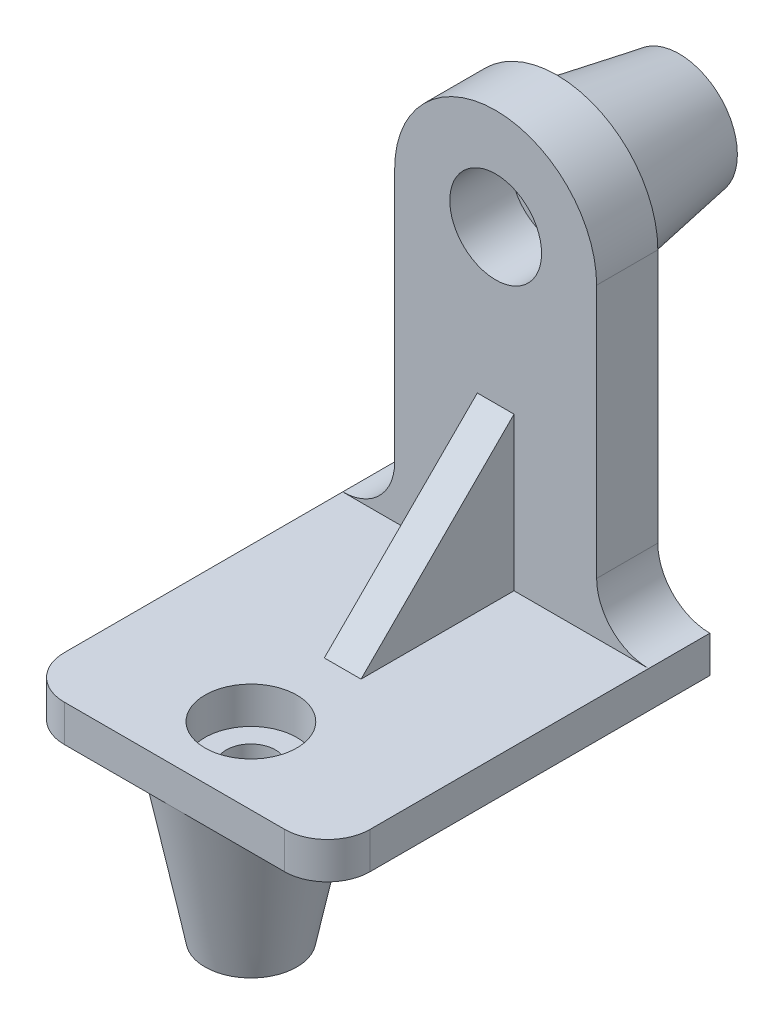
ISO-10303-21;
HEADER;
FILE_DESCRIPTION(('STEP AP214'),'2;1');
FILE_NAME('part.step','',(''),(''),'','','');
FILE_SCHEMA(('AUTOMOTIVE_DESIGN { 1 0 10303 214 1 1 1 1 }'));
ENDSEC;
DATA;
#1=APPLICATION_CONTEXT('core data for automotive mechanical design processes');
#2=APPLICATION_PROTOCOL_DEFINITION('international standard','automotive_design',2000,#1);
#3=PRODUCT_CONTEXT('',#1,'mechanical');
#4=PRODUCT('Part','Part','',(#3));
#5=PRODUCT_RELATED_PRODUCT_CATEGORY('part','',(#4));
#6=PRODUCT_DEFINITION_FORMATION('','',#4);
#7=PRODUCT_DEFINITION_CONTEXT('part definition',#1,'design');
#8=PRODUCT_DEFINITION('design','',#6,#7);
#9=PRODUCT_DEFINITION_SHAPE('','',#8);
#10=(LENGTH_UNIT() NAMED_UNIT(*) SI_UNIT(.MILLI.,.METRE.));
#11=(NAMED_UNIT(*) PLANE_ANGLE_UNIT() SI_UNIT($,.RADIAN.));
#12=(NAMED_UNIT(*) SI_UNIT($,.STERADIAN.) SOLID_ANGLE_UNIT());
#13=UNCERTAINTY_MEASURE_WITH_UNIT(LENGTH_MEASURE(1.E-05),#10,'distance_accuracy_value','');
#14=(GEOMETRIC_REPRESENTATION_CONTEXT(3) GLOBAL_UNCERTAINTY_ASSIGNED_CONTEXT((#13)) GLOBAL_UNIT_ASSIGNED_CONTEXT((#10,
#11,#12)) REPRESENTATION_CONTEXT('',''));
#15=CARTESIAN_POINT('',(0.,0.,0.));
#16=DIRECTION('',(0.,0.,1.));
#17=DIRECTION('',(1.,0.,0.));
#18=AXIS2_PLACEMENT_3D('',#15,#16,#17);
#19=CARTESIAN_POINT('',(50.,17.,0.));
#20=DIRECTION('',(0.,0.,-1.));
#21=DIRECTION('',(-1.,0.,0.));
#22=AXIS2_PLACEMENT_3D('',#19,#20,#21);
#23=PLANE('',#22);
#24=CARTESIAN_POINT('',(0.,100.,0.));
#25=DIRECTION('',(0.,0.,1.));
#26=DIRECTION('',(1.,0.,0.));
#27=AXIS2_PLACEMENT_3D('',#24,#25,#26);
#28=CIRCLE('',#27,15.);
#29=CARTESIAN_POINT('',(15.,100.,0.));
#30=VERTEX_POINT('',#29);
#31=EDGE_CURVE('E211',#30,#30,#28,.T.);
#32=ORIENTED_EDGE('',*,*,#31,.F.);
#33=EDGE_LOOP('',(#32));
#34=FACE_BOUND('',#33,.T.);
#35=DIRECTION('',(0.,1.,0.));
#36=VECTOR('',#35,1.);
#37=CARTESIAN_POINT('',(6.,0.,0.));
#38=LINE('',#37,#36);
#39=CARTESIAN_POINT('',(6.,0.,0.));
#40=VERTEX_POINT('',#39);
#41=CARTESIAN_POINT('',(6.,50.,0.));
#42=VERTEX_POINT('',#41);
#43=EDGE_CURVE('E161',#40,#42,#38,.T.);
#44=ORIENTED_EDGE('',*,*,#43,.F.);
#45=DIRECTION('',(1.,0.,0.));
#46=VECTOR('',#45,1.);
#47=CARTESIAN_POINT('',(-50.,0.,0.));
#48=LINE('',#47,#46);
#49=CARTESIAN_POINT('',(50.,0.,0.));
#50=VERTEX_POINT('',#49);
#51=EDGE_CURVE('E258',#40,#50,#48,.T.);
#52=ORIENTED_EDGE('',*,*,#51,.T.);
#53=CARTESIAN_POINT('',(50.,17.,0.));
#54=DIRECTION('',(0.,0.,-1.));
#55=DIRECTION('',(-1.,0.,0.));
#56=AXIS2_PLACEMENT_3D('',#53,#54,#55);
#57=CIRCLE('',#56,17.);
#58=CARTESIAN_POINT('',(33.,17.,0.));
#59=VERTEX_POINT('',#58);
#60=EDGE_CURVE('E225',#50,#59,#57,.T.);
#61=ORIENTED_EDGE('',*,*,#60,.T.);
#62=DIRECTION('',(0.,1.,0.));
#63=VECTOR('',#62,1.);
#64=CARTESIAN_POINT('',(33.,17.,0.));
#65=LINE('',#64,#63);
#66=CARTESIAN_POINT('',(33.,100.,0.));
#67=VERTEX_POINT('',#66);
#68=EDGE_CURVE('E246',#59,#67,#65,.T.);
#69=ORIENTED_EDGE('',*,*,#68,.T.);
#70=CARTESIAN_POINT('',(0.,100.,0.));
#71=DIRECTION('',(0.,0.,1.));
#72=DIRECTION('',(1.,0.,0.));
#73=AXIS2_PLACEMENT_3D('',#70,#71,#72);
#74=CIRCLE('',#73,33.);
#75=CARTESIAN_POINT('',(-33.,100.,0.));
#76=VERTEX_POINT('',#75);
#77=EDGE_CURVE('E249',#67,#76,#74,.T.);
#78=ORIENTED_EDGE('',*,*,#77,.T.);
#79=DIRECTION('',(0.,-1.,0.));
#80=VECTOR('',#79,1.);
#81=CARTESIAN_POINT('',(-33.,100.,0.));
#82=LINE('',#81,#80);
#83=CARTESIAN_POINT('',(-33.,17.,0.));
#84=VERTEX_POINT('',#83);
#85=EDGE_CURVE('E252',#76,#84,#82,.T.);
#86=ORIENTED_EDGE('',*,*,#85,.T.);
#87=CARTESIAN_POINT('',(-50.,17.,0.));
#88=DIRECTION('',(0.,0.,-1.));
#89=DIRECTION('',(-1.,0.,0.));
#90=AXIS2_PLACEMENT_3D('',#87,#88,#89);
#91=CIRCLE('',#90,17.);
#92=CARTESIAN_POINT('',(-50.,0.,0.));
#93=VERTEX_POINT('',#92);
#94=EDGE_CURVE('E255',#84,#93,#91,.T.);
#95=ORIENTED_EDGE('',*,*,#94,.T.);
#96=CARTESIAN_POINT('',(-6.,0.,0.));
#97=VERTEX_POINT('',#96);
#98=EDGE_CURVE('E232',#93,#97,#48,.T.);
#99=ORIENTED_EDGE('',*,*,#98,.T.);
#100=DIRECTION('',(0.,1.,0.));
#101=VECTOR('',#100,1.);
#102=CARTESIAN_POINT('',(-6.,0.,0.));
#103=LINE('',#102,#101);
#104=CARTESIAN_POINT('',(-6.,50.,0.));
#105=VERTEX_POINT('',#104);
#106=EDGE_CURVE('E158',#97,#105,#103,.T.);
#107=ORIENTED_EDGE('',*,*,#106,.T.);
#108=DIRECTION('',(-1.,0.,0.));
#109=VECTOR('',#108,1.);
#110=CARTESIAN_POINT('',(6.,50.,0.));
#111=LINE('',#110,#109);
#112=EDGE_CURVE('E59',#42,#105,#111,.T.);
#113=ORIENTED_EDGE('',*,*,#112,.F.);
#114=EDGE_LOOP('',(#44,#52,#61,#69,#78,#86,#95,#99,#107,#113));
#115=FACE_BOUND('',#114,.T.);
#116=ADVANCED_FACE('F37',(#34,#115),#23,.F.);
#117=CARTESIAN_POINT('',(-36.,0.,91.));
#118=DIRECTION('',(0.,1.,0.));
#119=DIRECTION('',(0.,0.,1.));
#120=AXIS2_PLACEMENT_3D('',#117,#118,#119);
#121=PLANE('',#120);
#122=CARTESIAN_POINT('',(0.,0.,80.));
#123=DIRECTION('',(0.,1.,0.));
#124=DIRECTION('',(0.,0.,1.));
#125=AXIS2_PLACEMENT_3D('',#122,#123,#124);
#126=CIRCLE('',#125,15.);
#127=CARTESIAN_POINT('',(0.,0.,95.));
#128=VERTEX_POINT('',#127);
#129=EDGE_CURVE('E169',#128,#128,#126,.T.);
#130=ORIENTED_EDGE('',*,*,#129,.F.);
#131=EDGE_LOOP('',(#130));
#132=FACE_BOUND('',#131,.T.);
#133=ORIENTED_EDGE('',*,*,#51,.F.);
#134=DIRECTION('',(0.,0.,-1.));
#135=VECTOR('',#134,1.);
#136=CARTESIAN_POINT('',(6.,0.,50.));
#137=LINE('',#136,#135);
#138=CARTESIAN_POINT('',(6.,0.,50.));
#139=VERTEX_POINT('',#138);
#140=EDGE_CURVE('E149',#139,#40,#137,.T.);
#141=ORIENTED_EDGE('',*,*,#140,.F.);
#142=DIRECTION('',(-1.,0.,0.));
#143=VECTOR('',#142,1.);
#144=CARTESIAN_POINT('',(6.,0.,50.));
#145=LINE('',#144,#143);
#146=CARTESIAN_POINT('',(-6.,0.,50.));
#147=VERTEX_POINT('',#146);
#148=EDGE_CURVE('E141',#139,#147,#145,.T.);
#149=ORIENTED_EDGE('',*,*,#148,.T.);
#150=DIRECTION('',(0.,0.,-1.));
#151=VECTOR('',#150,1.);
#152=CARTESIAN_POINT('',(-6.,0.,50.));
#153=LINE('',#152,#151);
#154=EDGE_CURVE('E146',#147,#97,#153,.T.);
#155=ORIENTED_EDGE('',*,*,#154,.T.);
#156=ORIENTED_EDGE('',*,*,#98,.F.);
#157=DIRECTION('',(0.,0.,1.));
#158=VECTOR('',#157,1.);
#159=CARTESIAN_POINT('',(-50.,0.,-20.));
#160=LINE('',#159,#158);
#161=CARTESIAN_POINT('',(-50.,0.,90.9999999999999));
#162=VERTEX_POINT('',#161);
#163=EDGE_CURVE('E173',#93,#162,#160,.T.);
#164=ORIENTED_EDGE('',*,*,#163,.T.);
#165=CARTESIAN_POINT('',(-36.,0.,91.));
#166=DIRECTION('',(0.,1.,0.));
#167=DIRECTION('',(0.,0.,1.));
#168=AXIS2_PLACEMENT_3D('',#165,#166,#167);
#169=CIRCLE('',#168,14.);
#170=CARTESIAN_POINT('',(-36.,0.,105.));
#171=VERTEX_POINT('',#170);
#172=EDGE_CURVE('E198',#162,#171,#169,.T.);
#173=ORIENTED_EDGE('',*,*,#172,.T.);
#174=DIRECTION('',(1.,0.,0.));
#175=VECTOR('',#174,1.);
#176=CARTESIAN_POINT('',(-35.9999999999999,0.,105.));
#177=LINE('',#176,#175);
#178=CARTESIAN_POINT('',(35.9999999999999,0.,105.));
#179=VERTEX_POINT('',#178);
#180=EDGE_CURVE('E201',#171,#179,#177,.T.);
#181=ORIENTED_EDGE('',*,*,#180,.T.);
#182=CARTESIAN_POINT('',(36.,0.,91.));
#183=DIRECTION('',(0.,1.,0.));
#184=DIRECTION('',(0.,0.,1.));
#185=AXIS2_PLACEMENT_3D('',#182,#183,#184);
#186=CIRCLE('',#185,14.);
#187=CARTESIAN_POINT('',(50.,0.,90.9999999999999));
#188=VERTEX_POINT('',#187);
#189=EDGE_CURVE('E204',#179,#188,#186,.T.);
#190=ORIENTED_EDGE('',*,*,#189,.T.);
#191=DIRECTION('',(0.,0.,-1.));
#192=VECTOR('',#191,1.);
#193=CARTESIAN_POINT('',(50.,0.,90.9999999999999));
#194=LINE('',#193,#192);
#195=EDGE_CURVE('E180',#188,#50,#194,.T.);
#196=ORIENTED_EDGE('',*,*,#195,.T.);
#197=EDGE_LOOP('',(#133,#141,#149,#155,#156,#164,#173,#181,#190,#196));
#198=FACE_BOUND('',#197,.T.);
#199=ADVANCED_FACE('F144',(#132,#198),#121,.T.);
#200=CARTESIAN_POINT('',(50.,17.,-20.));
#201=DIRECTION('',(0.,0.,1.));
#202=DIRECTION('',(1.,0.,0.));
#203=AXIS2_PLACEMENT_3D('',#200,#201,#202);
#204=CYLINDRICAL_SURFACE('',#203,17.);
#205=ORIENTED_EDGE('',*,*,#60,.F.);
#206=DIRECTION('',(0.,0.,1.));
#207=VECTOR('',#206,1.);
#208=CARTESIAN_POINT('',(50.,0.,-20.));
#209=LINE('',#208,#207);
#210=CARTESIAN_POINT('',(50.,0.,-20.));
#211=VERTEX_POINT('',#210);
#212=EDGE_CURVE('E11',#211,#50,#209,.T.);
#213=ORIENTED_EDGE('',*,*,#212,.F.);
#214=CARTESIAN_POINT('',(50.,17.,-20.));
#215=DIRECTION('',(0.,0.,-1.));
#216=DIRECTION('',(-1.,0.,0.));
#217=AXIS2_PLACEMENT_3D('',#214,#215,#216);
#218=CIRCLE('',#217,17.);
#219=CARTESIAN_POINT('',(33.,17.,-20.));
#220=VERTEX_POINT('',#219);
#221=EDGE_CURVE('E228',#211,#220,#218,.T.);
#222=ORIENTED_EDGE('',*,*,#221,.T.);
#223=DIRECTION('',(0.,0.,1.));
#224=VECTOR('',#223,1.);
#225=CARTESIAN_POINT('',(33.,17.,-20.));
#226=LINE('',#225,#224);
#227=EDGE_CURVE('E41',#220,#59,#226,.T.);
#228=ORIENTED_EDGE('',*,*,#227,.T.);
#229=EDGE_LOOP('',(#205,#213,#222,#228));
#230=FACE_BOUND('',#229,.T.);
#231=ADVANCED_FACE('F39',(#230),#204,.F.);
#232=CARTESIAN_POINT('',(-50.,17.,-20.));
#233=DIRECTION('',(0.,0.,1.));
#234=DIRECTION('',(1.,0.,0.));
#235=AXIS2_PLACEMENT_3D('',#232,#233,#234);
#236=CYLINDRICAL_SURFACE('',#235,17.);
#237=ORIENTED_EDGE('',*,*,#94,.F.);
#238=DIRECTION('',(0.,0.,1.));
#239=VECTOR('',#238,1.);
#240=CARTESIAN_POINT('',(-33.,17.,-20.));
#241=LINE('',#240,#239);
#242=CARTESIAN_POINT('',(-33.,17.,-20.));
#243=VERTEX_POINT('',#242);
#244=EDGE_CURVE('E262',#243,#84,#241,.T.);
#245=ORIENTED_EDGE('',*,*,#244,.F.);
#246=CARTESIAN_POINT('',(-50.,17.,-20.));
#247=DIRECTION('',(0.,0.,-1.));
#248=DIRECTION('',(-1.,0.,0.));
#249=AXIS2_PLACEMENT_3D('',#246,#247,#248);
#250=CIRCLE('',#249,17.);
#251=CARTESIAN_POINT('',(-50.,0.,-20.));
#252=VERTEX_POINT('',#251);
#253=EDGE_CURVE('E241',#243,#252,#250,.T.);
#254=ORIENTED_EDGE('',*,*,#253,.T.);
#255=DIRECTION('',(0.,0.,1.));
#256=VECTOR('',#255,1.);
#257=CARTESIAN_POINT('',(-50.,0.,-20.));
#258=LINE('',#257,#256);
#259=EDGE_CURVE('E46',#252,#93,#258,.T.);
#260=ORIENTED_EDGE('',*,*,#259,.T.);
#261=EDGE_LOOP('',(#237,#245,#254,#260));
#262=FACE_BOUND('',#261,.T.);
#263=ADVANCED_FACE('F292',(#262),#236,.F.);
#264=CARTESIAN_POINT('',(-33.,100.,-20.));
#265=DIRECTION('',(-1.,0.,0.));
#266=DIRECTION('',(0.,-1.,0.));
#267=AXIS2_PLACEMENT_3D('',#264,#265,#266);
#268=PLANE('',#267);
#269=ORIENTED_EDGE('',*,*,#85,.F.);
#270=DIRECTION('',(0.,0.,1.));
#271=VECTOR('',#270,1.);
#272=CARTESIAN_POINT('',(-33.,100.,-20.));
#273=LINE('',#272,#271);
#274=CARTESIAN_POINT('',(-33.,100.,-20.));
#275=VERTEX_POINT('',#274);
#276=EDGE_CURVE('E264',#275,#76,#273,.T.);
#277=ORIENTED_EDGE('',*,*,#276,.F.);
#278=DIRECTION('',(0.,-1.,0.));
#279=VECTOR('',#278,1.);
#280=CARTESIAN_POINT('',(-33.,100.,-20.));
#281=LINE('',#280,#279);
#282=EDGE_CURVE('E238',#275,#243,#281,.T.);
#283=ORIENTED_EDGE('',*,*,#282,.T.);
#284=ORIENTED_EDGE('',*,*,#244,.T.);
#285=EDGE_LOOP('',(#269,#277,#283,#284));
#286=FACE_BOUND('',#285,.T.);
#287=ADVANCED_FACE('F290',(#286),#268,.T.);
#288=CARTESIAN_POINT('',(0.,100.,-20.));
#289=DIRECTION('',(0.,0.,1.));
#290=DIRECTION('',(1.,0.,0.));
#291=AXIS2_PLACEMENT_3D('',#288,#289,#290);
#292=CYLINDRICAL_SURFACE('',#291,33.);
#293=ORIENTED_EDGE('',*,*,#77,.F.);
#294=DIRECTION('',(0.,0.,1.));
#295=VECTOR('',#294,1.);
#296=CARTESIAN_POINT('',(33.,100.,-20.));
#297=LINE('',#296,#295);
#298=CARTESIAN_POINT('',(33.,100.,-20.));
#299=VERTEX_POINT('',#298);
#300=EDGE_CURVE('E265',#299,#67,#297,.T.);
#301=ORIENTED_EDGE('',*,*,#300,.F.);
#302=CARTESIAN_POINT('',(0.,100.,-20.));
#303=DIRECTION('',(0.,0.,1.));
#304=DIRECTION('',(1.,0.,0.));
#305=AXIS2_PLACEMENT_3D('',#302,#303,#304);
#306=CIRCLE('',#305,33.);
#307=EDGE_CURVE('E235',#299,#275,#306,.T.);
#308=ORIENTED_EDGE('',*,*,#307,.T.);
#309=ORIENTED_EDGE('',*,*,#276,.T.);
#310=EDGE_LOOP('',(#293,#301,#308,#309));
#311=FACE_BOUND('',#310,.T.);
#312=ADVANCED_FACE('F286',(#311),#292,.T.);
#313=CARTESIAN_POINT('',(33.,17.,-20.));
#314=DIRECTION('',(1.,0.,0.));
#315=DIRECTION('',(0.,1.,0.));
#316=AXIS2_PLACEMENT_3D('',#313,#314,#315);
#317=PLANE('',#316);
#318=ORIENTED_EDGE('',*,*,#68,.F.);
#319=ORIENTED_EDGE('',*,*,#227,.F.);
#320=DIRECTION('',(0.,1.,0.));
#321=VECTOR('',#320,1.);
#322=CARTESIAN_POINT('',(33.,17.,-20.));
#323=LINE('',#322,#321);
#324=EDGE_CURVE('E231',#220,#299,#323,.T.);
#325=ORIENTED_EDGE('',*,*,#324,.T.);
#326=ORIENTED_EDGE('',*,*,#300,.T.);
#327=EDGE_LOOP('',(#318,#319,#325,#326));
#328=FACE_BOUND('',#327,.T.);
#329=ADVANCED_FACE('F274',(#328),#317,.T.);
#330=CARTESIAN_POINT('',(50.,17.,-20.));
#331=DIRECTION('',(0.,0.,-1.));
#332=DIRECTION('',(-1.,0.,0.));
#333=AXIS2_PLACEMENT_3D('',#330,#331,#332);
#334=PLANE('',#333);
#335=CARTESIAN_POINT('',(0.,100.,-20.));
#336=DIRECTION('',(0.,0.,1.));
#337=DIRECTION('',(1.,0.,0.));
#338=AXIS2_PLACEMENT_3D('',#335,#336,#337);
#339=CIRCLE('',#338,26.);
#340=CARTESIAN_POINT('',(26.,100.,-20.));
#341=VERTEX_POINT('',#340);
#342=EDGE_CURVE('E311',#341,#341,#339,.T.);
#343=ORIENTED_EDGE('',*,*,#342,.T.);
#344=EDGE_LOOP('',(#343));
#345=FACE_BOUND('',#344,.T.);
#346=ORIENTED_EDGE('',*,*,#221,.F.);
#347=DIRECTION('',(0.,1.,0.));
#348=VECTOR('',#347,1.);
#349=CARTESIAN_POINT('',(50.,-12.,-20.));
#350=LINE('',#349,#348);
#351=CARTESIAN_POINT('',(50.,-12.,-20.));
#352=VERTEX_POINT('',#351);
#353=EDGE_CURVE('E209',#352,#211,#350,.T.);
#354=ORIENTED_EDGE('',*,*,#353,.F.);
#355=DIRECTION('',(-1.,0.,0.));
#356=VECTOR('',#355,1.);
#357=CARTESIAN_POINT('',(50.,-12.,-20.));
#358=LINE('',#357,#356);
#359=CARTESIAN_POINT('',(-50.,-12.,-20.));
#360=VERTEX_POINT('',#359);
#361=EDGE_CURVE('E176',#352,#360,#358,.T.);
#362=ORIENTED_EDGE('',*,*,#361,.T.);
#363=DIRECTION('',(0.,1.,0.));
#364=VECTOR('',#363,1.);
#365=CARTESIAN_POINT('',(-50.,-12.,-20.));
#366=LINE('',#365,#364);
#367=EDGE_CURVE('E196',#360,#252,#366,.T.);
#368=ORIENTED_EDGE('',*,*,#367,.T.);
#369=ORIENTED_EDGE('',*,*,#253,.F.);
#370=ORIENTED_EDGE('',*,*,#282,.F.);
#371=ORIENTED_EDGE('',*,*,#307,.F.);
#372=ORIENTED_EDGE('',*,*,#324,.F.);
#373=EDGE_LOOP('',(#346,#354,#362,#368,#369,#370,#371,#372));
#374=FACE_BOUND('',#373,.T.);
#375=ADVANCED_FACE('F280',(#345,#374),#334,.T.);
#376=CARTESIAN_POINT('',(0.,100.,-20.));
#377=DIRECTION('',(0.,0.,1.));
#378=DIRECTION('',(1.,0.,0.));
#379=AXIS2_PLACEMENT_3D('',#376,#377,#378);
#380=CYLINDRICAL_SURFACE('',#379,15.);
#381=CARTESIAN_POINT('',(0.,100.,-20.));
#382=DIRECTION('',(0.,0.,1.));
#383=DIRECTION('',(1.,0.,0.));
#384=AXIS2_PLACEMENT_3D('',#381,#382,#383);
#385=CIRCLE('',#384,15.);
#386=CARTESIAN_POINT('',(15.,100.,-20.));
#387=VERTEX_POINT('',#386);
#388=EDGE_CURVE('E222',#387,#387,#385,.T.);
#389=ORIENTED_EDGE('',*,*,#388,.F.);
#390=EDGE_LOOP('',(#389));
#391=FACE_BOUND('',#390,.T.);
#392=ORIENTED_EDGE('',*,*,#31,.T.);
#393=EDGE_LOOP('',(#392));
#394=FACE_BOUND('',#393,.T.);
#395=ADVANCED_FACE('F345',(#391,#394),#380,.F.);
#396=CARTESIAN_POINT('',(50.,-12.,90.9999999999999));
#397=DIRECTION('',(1.,0.,0.));
#398=DIRECTION('',(0.,0.,-1.));
#399=AXIS2_PLACEMENT_3D('',#396,#397,#398);
#400=PLANE('',#399);
#401=ORIENTED_EDGE('',*,*,#195,.F.);
#402=DIRECTION('',(0.,1.,0.));
#403=VECTOR('',#402,1.);
#404=CARTESIAN_POINT('',(50.,-12.,90.9999999999999));
#405=LINE('',#404,#403);
#406=CARTESIAN_POINT('',(50.,-12.,90.9999999999999));
#407=VERTEX_POINT('',#406);
#408=EDGE_CURVE('E212',#407,#188,#405,.T.);
#409=ORIENTED_EDGE('',*,*,#408,.F.);
#410=DIRECTION('',(0.,0.,-1.));
#411=VECTOR('',#410,1.);
#412=CARTESIAN_POINT('',(50.,-12.,90.9999999999999));
#413=LINE('',#412,#411);
#414=EDGE_CURVE('E193',#407,#352,#413,.T.);
#415=ORIENTED_EDGE('',*,*,#414,.T.);
#416=ORIENTED_EDGE('',*,*,#353,.T.);
#417=ORIENTED_EDGE('',*,*,#212,.T.);
#418=EDGE_LOOP('',(#401,#409,#415,#416,#417));
#419=FACE_BOUND('',#418,.T.);
#420=ADVANCED_FACE('F278',(#419),#400,.T.);
#421=CARTESIAN_POINT('',(36.,-12.,91.));
#422=DIRECTION('',(0.,1.,0.));
#423=DIRECTION('',(0.,0.,1.));
#424=AXIS2_PLACEMENT_3D('',#421,#422,#423);
#425=CYLINDRICAL_SURFACE('',#424,14.);
#426=ORIENTED_EDGE('',*,*,#189,.F.);
#427=DIRECTION('',(0.,1.,0.));
#428=VECTOR('',#427,1.);
#429=CARTESIAN_POINT('',(35.9999999999999,-12.,105.));
#430=LINE('',#429,#428);
#431=CARTESIAN_POINT('',(35.9999999999999,-12.,105.));
#432=VERTEX_POINT('',#431);
#433=EDGE_CURVE('E214',#432,#179,#430,.T.);
#434=ORIENTED_EDGE('',*,*,#433,.F.);
#435=CARTESIAN_POINT('',(36.,-12.,91.));
#436=DIRECTION('',(0.,1.,0.));
#437=DIRECTION('',(0.,0.,1.));
#438=AXIS2_PLACEMENT_3D('',#435,#436,#437);
#439=CIRCLE('',#438,14.);
#440=EDGE_CURVE('E190',#432,#407,#439,.T.);
#441=ORIENTED_EDGE('',*,*,#440,.T.);
#442=ORIENTED_EDGE('',*,*,#408,.T.);
#443=EDGE_LOOP('',(#426,#434,#441,#442));
#444=FACE_BOUND('',#443,.T.);
#445=ADVANCED_FACE('F337',(#444),#425,.T.);
#446=CARTESIAN_POINT('',(-35.9999999999999,-12.,105.));
#447=DIRECTION('',(0.,0.,1.));
#448=DIRECTION('',(1.,0.,0.));
#449=AXIS2_PLACEMENT_3D('',#446,#447,#448);
#450=PLANE('',#449);
#451=ORIENTED_EDGE('',*,*,#180,.F.);
#452=DIRECTION('',(0.,1.,0.));
#453=VECTOR('',#452,1.);
#454=CARTESIAN_POINT('',(-36.,-12.,105.));
#455=LINE('',#454,#453);
#456=CARTESIAN_POINT('',(-36.,-12.,105.));
#457=VERTEX_POINT('',#456);
#458=EDGE_CURVE('E216',#457,#171,#455,.T.);
#459=ORIENTED_EDGE('',*,*,#458,.F.);
#460=DIRECTION('',(1.,0.,0.));
#461=VECTOR('',#460,1.);
#462=CARTESIAN_POINT('',(-35.9999999999999,-12.,105.));
#463=LINE('',#462,#461);
#464=CARTESIAN_POINT('',(0.,-12.,105.));
#465=VERTEX_POINT('',#464);
#466=EDGE_CURVE('E187',#457,#465,#463,.T.);
#467=ORIENTED_EDGE('',*,*,#466,.T.);
#468=EDGE_CURVE('E186',#465,#432,#463,.T.);
#469=ORIENTED_EDGE('',*,*,#468,.T.);
#470=ORIENTED_EDGE('',*,*,#433,.T.);
#471=EDGE_LOOP('',(#451,#459,#467,#469,#470));
#472=FACE_BOUND('',#471,.T.);
#473=ADVANCED_FACE('F333',(#472),#450,.T.);
#474=CARTESIAN_POINT('',(-36.,-12.,91.));
#475=DIRECTION('',(0.,1.,0.));
#476=DIRECTION('',(0.,0.,1.));
#477=AXIS2_PLACEMENT_3D('',#474,#475,#476);
#478=CYLINDRICAL_SURFACE('',#477,14.);
#479=ORIENTED_EDGE('',*,*,#172,.F.);
#480=DIRECTION('',(0.,1.,0.));
#481=VECTOR('',#480,1.);
#482=CARTESIAN_POINT('',(-50.,-12.,90.9999999999999));
#483=LINE('',#482,#481);
#484=CARTESIAN_POINT('',(-50.,-12.,90.9999999999999));
#485=VERTEX_POINT('',#484);
#486=EDGE_CURVE('E218',#485,#162,#483,.T.);
#487=ORIENTED_EDGE('',*,*,#486,.F.);
#488=CARTESIAN_POINT('',(-36.,-12.,91.));
#489=DIRECTION('',(0.,1.,0.));
#490=DIRECTION('',(0.,0.,1.));
#491=AXIS2_PLACEMENT_3D('',#488,#489,#490);
#492=CIRCLE('',#491,14.);
#493=EDGE_CURVE('E183',#485,#457,#492,.T.);
#494=ORIENTED_EDGE('',*,*,#493,.T.);
#495=ORIENTED_EDGE('',*,*,#458,.T.);
#496=EDGE_LOOP('',(#479,#487,#494,#495));
#497=FACE_BOUND('',#496,.T.);
#498=ADVANCED_FACE('F335',(#497),#478,.T.);
#499=CARTESIAN_POINT('',(-50.,-12.,-20.));
#500=DIRECTION('',(-1.,0.,0.));
#501=DIRECTION('',(0.,0.,1.));
#502=AXIS2_PLACEMENT_3D('',#499,#500,#501);
#503=PLANE('',#502);
#504=ORIENTED_EDGE('',*,*,#259,.F.);
#505=ORIENTED_EDGE('',*,*,#367,.F.);
#506=DIRECTION('',(0.,0.,1.));
#507=VECTOR('',#506,1.);
#508=CARTESIAN_POINT('',(-50.,-12.,-20.));
#509=LINE('',#508,#507);
#510=EDGE_CURVE('E179',#360,#485,#509,.T.);
#511=ORIENTED_EDGE('',*,*,#510,.T.);
#512=ORIENTED_EDGE('',*,*,#486,.T.);
#513=ORIENTED_EDGE('',*,*,#163,.F.);
#514=EDGE_LOOP('',(#504,#505,#511,#512,#513));
#515=FACE_BOUND('',#514,.T.);
#516=ADVANCED_FACE('F296',(#515),#503,.T.);
#517=CARTESIAN_POINT('',(-36.,-12.,91.));
#518=DIRECTION('',(0.,1.,0.));
#519=DIRECTION('',(0.,0.,1.));
#520=AXIS2_PLACEMENT_3D('',#517,#518,#519);
#521=PLANE('',#520);
#522=ORIENTED_EDGE('',*,*,#468,.F.);
#523=CARTESIAN_POINT('',(0.,-12.,80.));
#524=DIRECTION('',(0.,1.,0.));
#525=DIRECTION('',(0.,0.,1.));
#526=AXIS2_PLACEMENT_3D('',#523,#524,#525);
#527=CIRCLE('',#526,25.);
#528=EDGE_CURVE('E52',#465,#465,#527,.T.);
#529=ORIENTED_EDGE('',*,*,#528,.T.);
#530=ORIENTED_EDGE('',*,*,#466,.F.);
#531=ORIENTED_EDGE('',*,*,#493,.F.);
#532=ORIENTED_EDGE('',*,*,#510,.F.);
#533=ORIENTED_EDGE('',*,*,#361,.F.);
#534=ORIENTED_EDGE('',*,*,#414,.F.);
#535=ORIENTED_EDGE('',*,*,#440,.F.);
#536=EDGE_LOOP('',(#522,#529,#530,#531,#532,#533,#534,#535));
#537=FACE_BOUND('',#536,.T.);
#538=ADVANCED_FACE('F326',(#537),#521,.F.);
#539=CARTESIAN_POINT('',(0.,-12.,80.));
#540=DIRECTION('',(0.,1.,0.));
#541=DIRECTION('',(0.,0.,1.));
#542=AXIS2_PLACEMENT_3D('',#539,#540,#541);
#543=CYLINDRICAL_SURFACE('',#542,15.);
#544=CARTESIAN_POINT('',(0.,-12.,80.));
#545=DIRECTION('',(0.,1.,0.));
#546=DIRECTION('',(0.,0.,1.));
#547=AXIS2_PLACEMENT_3D('',#544,#545,#546);
#548=CIRCLE('',#547,15.);
#549=CARTESIAN_POINT('',(0.,-12.,95.));
#550=VERTEX_POINT('',#549);
#551=EDGE_CURVE('E170',#550,#550,#548,.T.);
#552=ORIENTED_EDGE('',*,*,#551,.F.);
#553=EDGE_LOOP('',(#552));
#554=FACE_BOUND('',#553,.T.);
#555=ORIENTED_EDGE('',*,*,#129,.T.);
#556=EDGE_LOOP('',(#555));
#557=FACE_BOUND('',#556,.T.);
#558=ADVANCED_FACE('F400',(#554,#557),#543,.F.);
#559=CARTESIAN_POINT('',(6.,50.,0.));
#560=DIRECTION('',(0.,-0.707106781186548,-0.707106781186548));
#561=DIRECTION('',(0.,0.707106781186548,-0.707106781186548));
#562=AXIS2_PLACEMENT_3D('',#559,#560,#561);
#563=PLANE('',#562);
#564=DIRECTION('',(0.,-0.707106781186547,0.707106781186547));
#565=VECTOR('',#564,1.);
#566=CARTESIAN_POINT('',(-6.,50.,0.));
#567=LINE('',#566,#565);
#568=EDGE_CURVE('E154',#105,#147,#567,.T.);
#569=ORIENTED_EDGE('',*,*,#568,.T.);
#570=ORIENTED_EDGE('',*,*,#148,.F.);
#571=DIRECTION('',(0.,-0.707106781186547,0.707106781186547));
#572=VECTOR('',#571,1.);
#573=CARTESIAN_POINT('',(6.,50.,0.));
#574=LINE('',#573,#572);
#575=EDGE_CURVE('E164',#42,#139,#574,.T.);
#576=ORIENTED_EDGE('',*,*,#575,.F.);
#577=ORIENTED_EDGE('',*,*,#112,.T.);
#578=EDGE_LOOP('',(#569,#570,#576,#577));
#579=FACE_BOUND('',#578,.T.);
#580=ADVANCED_FACE('F155',(#579),#563,.F.);
#581=CARTESIAN_POINT('',(6.,0.,0.));
#582=DIRECTION('',(-1.,0.,0.));
#583=DIRECTION('',(0.,0.,1.));
#584=AXIS2_PLACEMENT_3D('',#581,#582,#583);
#585=PLANE('',#584);
#586=ORIENTED_EDGE('',*,*,#43,.T.);
#587=ORIENTED_EDGE('',*,*,#575,.T.);
#588=ORIENTED_EDGE('',*,*,#140,.T.);
#589=EDGE_LOOP('',(#586,#587,#588));
#590=FACE_BOUND('',#589,.T.);
#591=ADVANCED_FACE('F392',(#590),#585,.F.);
#592=CARTESIAN_POINT('',(-6.,0.,0.));
#593=DIRECTION('',(-1.,0.,0.));
#594=DIRECTION('',(0.,0.,1.));
#595=AXIS2_PLACEMENT_3D('',#592,#593,#594);
#596=PLANE('',#595);
#597=ORIENTED_EDGE('',*,*,#106,.F.);
#598=ORIENTED_EDGE('',*,*,#154,.F.);
#599=ORIENTED_EDGE('',*,*,#568,.F.);
#600=EDGE_LOOP('',(#597,#598,#599));
#601=FACE_BOUND('',#600,.T.);
#602=ADVANCED_FACE('F160',(#601),#596,.T.);
#603=CARTESIAN_POINT('',(0.,126.,-20.));
#604=DIRECTION('',(0.,0.,-1.));
#605=DIRECTION('',(-1.,0.,0.));
#606=AXIS2_PLACEMENT_3D('',#603,#604,#605);
#607=PLANE('',#606);
#608=CARTESIAN_POINT('',(0.,100.,-20.));
#609=DIRECTION('',(0.,0.,1.));
#610=DIRECTION('',(1.,0.,0.));
#611=AXIS2_PLACEMENT_3D('',#608,#609,#610);
#612=CIRCLE('',#611,9.99999999999999);
#613=CARTESIAN_POINT('',(9.99999999999999,100.,-20.));
#614=VERTEX_POINT('',#613);
#615=EDGE_CURVE('E308',#614,#614,#612,.T.);
#616=ORIENTED_EDGE('',*,*,#615,.F.);
#617=EDGE_LOOP('',(#616));
#618=FACE_BOUND('',#617,.T.);
#619=ORIENTED_EDGE('',*,*,#388,.T.);
#620=EDGE_LOOP('',(#619));
#621=FACE_BOUND('',#620,.T.);
#622=ADVANCED_FACE('F378',(#618,#621),#607,.F.);
#623=CARTESIAN_POINT('',(0.,100.,-20.));
#624=DIRECTION('',(0.,0.,1.));
#625=DIRECTION('',(1.,0.,0.));
#626=AXIS2_PLACEMENT_3D('',#623,#624,#625);
#627=CONICAL_SURFACE('',#626,26.,0.173245666452365);
#628=CARTESIAN_POINT('',(0.,100.,-60.));
#629=DIRECTION('',(0.,0.,1.));
#630=DIRECTION('',(1.,0.,0.));
#631=AXIS2_PLACEMENT_3D('',#628,#629,#630);
#632=CIRCLE('',#631,19.);
#633=CARTESIAN_POINT('',(19.,100.,-60.));
#634=VERTEX_POINT('',#633);
#635=EDGE_CURVE('E299',#634,#634,#632,.T.);
#636=ORIENTED_EDGE('',*,*,#635,.T.);
#637=EDGE_LOOP('',(#636));
#638=FACE_BOUND('',#637,.T.);
#639=ORIENTED_EDGE('',*,*,#342,.F.);
#640=EDGE_LOOP('',(#639));
#641=FACE_BOUND('',#640,.T.);
#642=ADVANCED_FACE('F375',(#638,#641),#627,.T.);
#643=CARTESIAN_POINT('',(0.,119.,-60.));
#644=DIRECTION('',(0.,0.,-1.));
#645=DIRECTION('',(-1.,0.,0.));
#646=AXIS2_PLACEMENT_3D('',#643,#644,#645);
#647=PLANE('',#646);
#648=CARTESIAN_POINT('',(0.,100.,-60.));
#649=DIRECTION('',(0.,0.,1.));
#650=DIRECTION('',(1.,0.,0.));
#651=AXIS2_PLACEMENT_3D('',#648,#649,#650);
#652=CIRCLE('',#651,9.99999999999999);
#653=CARTESIAN_POINT('',(9.99999999999999,100.,-60.));
#654=VERTEX_POINT('',#653);
#655=EDGE_CURVE('E301',#654,#654,#652,.T.);
#656=ORIENTED_EDGE('',*,*,#655,.T.);
#657=EDGE_LOOP('',(#656));
#658=FACE_BOUND('',#657,.T.);
#659=ORIENTED_EDGE('',*,*,#635,.F.);
#660=EDGE_LOOP('',(#659));
#661=FACE_BOUND('',#660,.T.);
#662=ADVANCED_FACE('F377',(#658,#661),#647,.T.);
#663=CARTESIAN_POINT('',(0.,100.,0.));
#664=DIRECTION('',(0.,0.,1.));
#665=DIRECTION('',(1.,0.,0.));
#666=AXIS2_PLACEMENT_3D('',#663,#664,#665);
#667=CYLINDRICAL_SURFACE('',#666,9.99999999999999);
#668=ORIENTED_EDGE('',*,*,#615,.T.);
#669=EDGE_LOOP('',(#668));
#670=FACE_BOUND('',#669,.T.);
#671=ORIENTED_EDGE('',*,*,#655,.F.);
#672=EDGE_LOOP('',(#671));
#673=FACE_BOUND('',#672,.T.);
#674=ADVANCED_FACE('F385',(#670,#673),#667,.F.);
#675=CARTESIAN_POINT('',(0.,-12.,88.));
#676=DIRECTION('',(0.,1.,0.));
#677=DIRECTION('',(0.,0.,1.));
#678=AXIS2_PLACEMENT_3D('',#675,#676,#677);
#679=PLANE('',#678);
#680=ORIENTED_EDGE('',*,*,#551,.T.);
#681=EDGE_LOOP('',(#680));
#682=FACE_BOUND('',#681,.T.);
#683=CARTESIAN_POINT('',(0.,-12.,80.));
#684=DIRECTION('',(0.,1.,0.));
#685=DIRECTION('',(0.,0.,1.));
#686=AXIS2_PLACEMENT_3D('',#683,#684,#685);
#687=CIRCLE('',#686,7.99999999999999);
#688=CARTESIAN_POINT('',(0.,-12.,88.));
#689=VERTEX_POINT('',#688);
#690=EDGE_CURVE('E314',#689,#689,#687,.T.);
#691=ORIENTED_EDGE('',*,*,#690,.F.);
#692=EDGE_LOOP('',(#691));
#693=FACE_BOUND('',#692,.T.);
#694=ADVANCED_FACE('F436',(#682,#693),#679,.T.);
#695=CARTESIAN_POINT('',(0.,-12.,80.));
#696=DIRECTION('',(0.,1.,0.));
#697=DIRECTION('',(0.,0.,1.));
#698=AXIS2_PLACEMENT_3D('',#695,#696,#697);
#699=CYLINDRICAL_SURFACE('',#698,7.99999999999999);
#700=ORIENTED_EDGE('',*,*,#690,.T.);
#701=EDGE_LOOP('',(#700));
#702=FACE_BOUND('',#701,.T.);
#703=CARTESIAN_POINT('',(0.,-62.,80.));
#704=DIRECTION('',(0.,1.,0.));
#705=DIRECTION('',(0.,0.,1.));
#706=AXIS2_PLACEMENT_3D('',#703,#704,#705);
#707=CIRCLE('',#706,8.);
#708=CARTESIAN_POINT('',(0.,-62.,88.));
#709=VERTEX_POINT('',#708);
#710=EDGE_CURVE('E317',#709,#709,#707,.T.);
#711=ORIENTED_EDGE('',*,*,#710,.F.);
#712=EDGE_LOOP('',(#711));
#713=FACE_BOUND('',#712,.T.);
#714=ADVANCED_FACE('F441',(#702,#713),#699,.F.);
#715=CARTESIAN_POINT('',(0.,-62.,95.));
#716=DIRECTION('',(0.,-1.,0.));
#717=DIRECTION('',(0.,0.,-1.));
#718=AXIS2_PLACEMENT_3D('',#715,#716,#717);
#719=PLANE('',#718);
#720=ORIENTED_EDGE('',*,*,#710,.T.);
#721=EDGE_LOOP('',(#720));
#722=FACE_BOUND('',#721,.T.);
#723=CARTESIAN_POINT('',(0.,-62.,80.));
#724=DIRECTION('',(0.,1.,0.));
#725=DIRECTION('',(0.,0.,1.));
#726=AXIS2_PLACEMENT_3D('',#723,#724,#725);
#727=CIRCLE('',#726,15.);
#728=CARTESIAN_POINT('',(0.,-62.,95.));
#729=VERTEX_POINT('',#728);
#730=EDGE_CURVE('E320',#729,#729,#727,.T.);
#731=ORIENTED_EDGE('',*,*,#730,.F.);
#732=EDGE_LOOP('',(#731));
#733=FACE_BOUND('',#732,.T.);
#734=ADVANCED_FACE('F451',(#722,#733),#719,.T.);
#735=CARTESIAN_POINT('',(0.,-12.,80.));
#736=DIRECTION('',(0.,1.,0.));
#737=DIRECTION('',(0.,0.,1.));
#738=AXIS2_PLACEMENT_3D('',#735,#736,#737);
#739=CONICAL_SURFACE('',#738,25.,0.197395559849881);
#740=ORIENTED_EDGE('',*,*,#730,.T.);
#741=EDGE_LOOP('',(#740));
#742=FACE_BOUND('',#741,.T.);
#743=ORIENTED_EDGE('',*,*,#528,.F.);
#744=EDGE_LOOP('',(#743));
#745=FACE_BOUND('',#744,.T.);
#746=ADVANCED_FACE('F461',(#742,#745),#739,.T.);
#747=CLOSED_SHELL('',(#116,#199,#231,#263,#287,#312,#329,#375,#395,#420,#445,#473,#498,#516,
#538,#558,#580,#591,#602,#622,#642,#662,#674,#694,#714,#734,#746));
#748=MANIFOLD_SOLID_BREP('B2',#747);
#749=ADVANCED_BREP_SHAPE_REPRESENTATION('',(#18,#748),#14);
#750=SHAPE_DEFINITION_REPRESENTATION(#9,#749);
ENDSEC;
END-ISO-10303-21;
